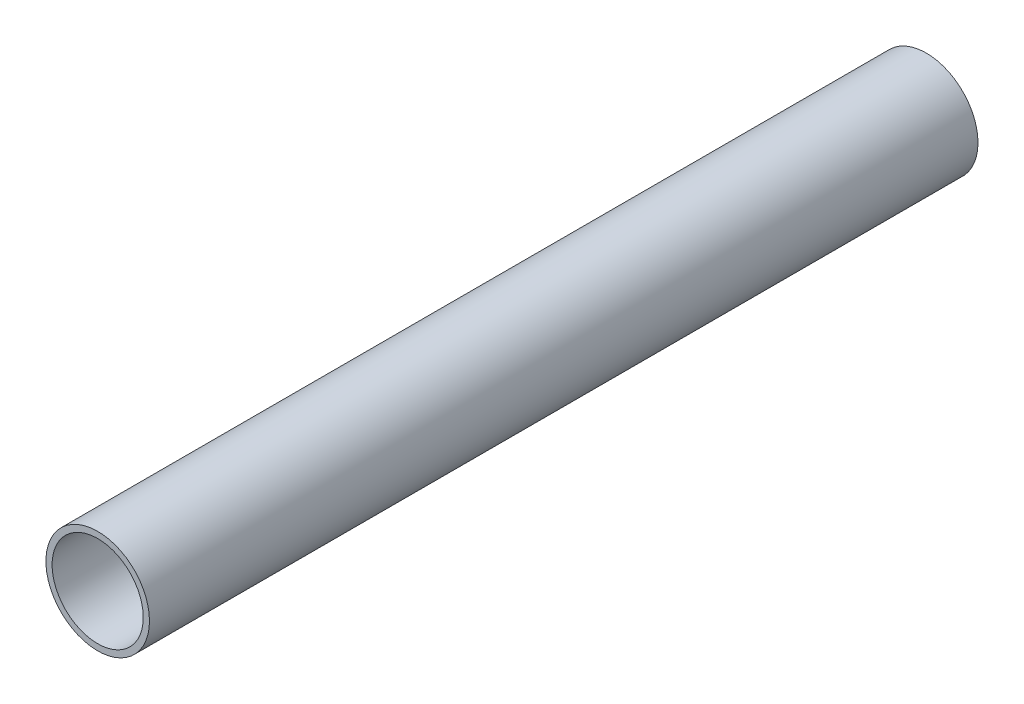
ISO-10303-21;
HEADER;
FILE_DESCRIPTION(('STEP AP214'),'2;1');
FILE_NAME('part.step','',(''),(''),'','','');
FILE_SCHEMA(('AUTOMOTIVE_DESIGN { 1 0 10303 214 1 1 1 1 }'));
ENDSEC;
DATA;
#1=APPLICATION_CONTEXT('core data for automotive mechanical design processes');
#2=APPLICATION_PROTOCOL_DEFINITION('international standard','automotive_design',2000,#1);
#3=PRODUCT_CONTEXT('',#1,'mechanical');
#4=PRODUCT('Part','Part','',(#3));
#5=PRODUCT_RELATED_PRODUCT_CATEGORY('part','',(#4));
#6=PRODUCT_DEFINITION_FORMATION('','',#4);
#7=PRODUCT_DEFINITION_CONTEXT('part definition',#1,'design');
#8=PRODUCT_DEFINITION('design','',#6,#7);
#9=PRODUCT_DEFINITION_SHAPE('','',#8);
#10=(LENGTH_UNIT() NAMED_UNIT(*) SI_UNIT(.MILLI.,.METRE.));
#11=(NAMED_UNIT(*) PLANE_ANGLE_UNIT() SI_UNIT($,.RADIAN.));
#12=(NAMED_UNIT(*) SI_UNIT($,.STERADIAN.) SOLID_ANGLE_UNIT());
#13=UNCERTAINTY_MEASURE_WITH_UNIT(LENGTH_MEASURE(1.E-05),#10,'distance_accuracy_value','');
#14=(GEOMETRIC_REPRESENTATION_CONTEXT(3) GLOBAL_UNCERTAINTY_ASSIGNED_CONTEXT((#13)) GLOBAL_UNIT_ASSIGNED_CONTEXT((#10,
#11,#12)) REPRESENTATION_CONTEXT('',''));
#15=CARTESIAN_POINT('',(0.,0.,0.));
#16=DIRECTION('',(0.,0.,1.));
#17=DIRECTION('',(1.,0.,0.));
#18=AXIS2_PLACEMENT_3D('',#15,#16,#17);
#19=CARTESIAN_POINT('',(0.,0.,200.));
#20=DIRECTION('',(0.,0.,1.));
#21=DIRECTION('',(1.,0.,0.));
#22=AXIS2_PLACEMENT_3D('',#19,#20,#21);
#23=PLANE('',#22);
#24=CARTESIAN_POINT('',(0.,0.,200.));
#25=DIRECTION('',(0.,0.,1.));
#26=DIRECTION('',(1.,0.,0.));
#27=AXIS2_PLACEMENT_3D('',#24,#25,#26);
#28=CIRCLE('',#27,12.5);
#29=CARTESIAN_POINT('',(12.5,0.,200.));
#30=VERTEX_POINT('',#29);
#31=EDGE_CURVE('E10',#30,#30,#28,.T.);
#32=ORIENTED_EDGE('',*,*,#31,.T.);
#33=EDGE_LOOP('',(#32));
#34=FACE_BOUND('',#33,.T.);
#35=CARTESIAN_POINT('',(0.,0.,200.));
#36=DIRECTION('',(0.,0.,1.));
#37=DIRECTION('',(1.,0.,0.));
#38=AXIS2_PLACEMENT_3D('',#35,#36,#37);
#39=CIRCLE('',#38,11.);
#40=CARTESIAN_POINT('',(11.,0.,200.));
#41=VERTEX_POINT('',#40);
#42=EDGE_CURVE('E50',#41,#41,#39,.T.);
#43=ORIENTED_EDGE('',*,*,#42,.F.);
#44=EDGE_LOOP('',(#43));
#45=FACE_BOUND('',#44,.T.);
#46=ADVANCED_FACE('F39',(#34,#45),#23,.T.);
#47=CARTESIAN_POINT('',(0.,0.,0.));
#48=DIRECTION('',(0.,0.,1.));
#49=DIRECTION('',(1.,0.,0.));
#50=AXIS2_PLACEMENT_3D('',#47,#48,#49);
#51=PLANE('',#50);
#52=CARTESIAN_POINT('',(0.,0.,0.));
#53=DIRECTION('',(0.,0.,1.));
#54=DIRECTION('',(1.,0.,0.));
#55=AXIS2_PLACEMENT_3D('',#52,#53,#54);
#56=CIRCLE('',#55,12.5);
#57=CARTESIAN_POINT('',(12.5,0.,0.));
#58=VERTEX_POINT('',#57);
#59=EDGE_CURVE('E43',#58,#58,#56,.T.);
#60=ORIENTED_EDGE('',*,*,#59,.F.);
#61=EDGE_LOOP('',(#60));
#62=FACE_BOUND('',#61,.T.);
#63=CARTESIAN_POINT('',(0.,0.,0.));
#64=DIRECTION('',(0.,0.,1.));
#65=DIRECTION('',(1.,0.,0.));
#66=AXIS2_PLACEMENT_3D('',#63,#64,#65);
#67=CIRCLE('',#66,11.);
#68=CARTESIAN_POINT('',(11.,0.,0.));
#69=VERTEX_POINT('',#68);
#70=EDGE_CURVE('E52',#69,#69,#67,.T.);
#71=ORIENTED_EDGE('',*,*,#70,.T.);
#72=EDGE_LOOP('',(#71));
#73=FACE_BOUND('',#72,.T.);
#74=ADVANCED_FACE('F62',(#62,#73),#51,.F.);
#75=CARTESIAN_POINT('',(0.,0.,200.));
#76=DIRECTION('',(0.,0.,-1.));
#77=DIRECTION('',(-1.,0.,0.));
#78=AXIS2_PLACEMENT_3D('',#75,#76,#77);
#79=CYLINDRICAL_SURFACE('',#78,12.5);
#80=ORIENTED_EDGE('',*,*,#31,.F.);
#81=EDGE_LOOP('',(#80));
#82=FACE_BOUND('',#81,.T.);
#83=ORIENTED_EDGE('',*,*,#59,.T.);
#84=EDGE_LOOP('',(#83));
#85=FACE_BOUND('',#84,.T.);
#86=ADVANCED_FACE('F41',(#82,#85),#79,.T.);
#87=CARTESIAN_POINT('',(0.,0.,200.));
#88=DIRECTION('',(0.,0.,-1.));
#89=DIRECTION('',(-1.,0.,0.));
#90=AXIS2_PLACEMENT_3D('',#87,#88,#89);
#91=CYLINDRICAL_SURFACE('',#90,11.);
#92=ORIENTED_EDGE('',*,*,#42,.T.);
#93=EDGE_LOOP('',(#92));
#94=FACE_BOUND('',#93,.T.);
#95=ORIENTED_EDGE('',*,*,#70,.F.);
#96=EDGE_LOOP('',(#95));
#97=FACE_BOUND('',#96,.T.);
#98=ADVANCED_FACE('F58',(#94,#97),#91,.F.);
#99=CLOSED_SHELL('',(#46,#74,#86,#98));
#100=MANIFOLD_SOLID_BREP('B2',#99);
#101=ADVANCED_BREP_SHAPE_REPRESENTATION('',(#18,#100),#14);
#102=SHAPE_DEFINITION_REPRESENTATION(#9,#101);
ENDSEC;
END-ISO-10303-21;
